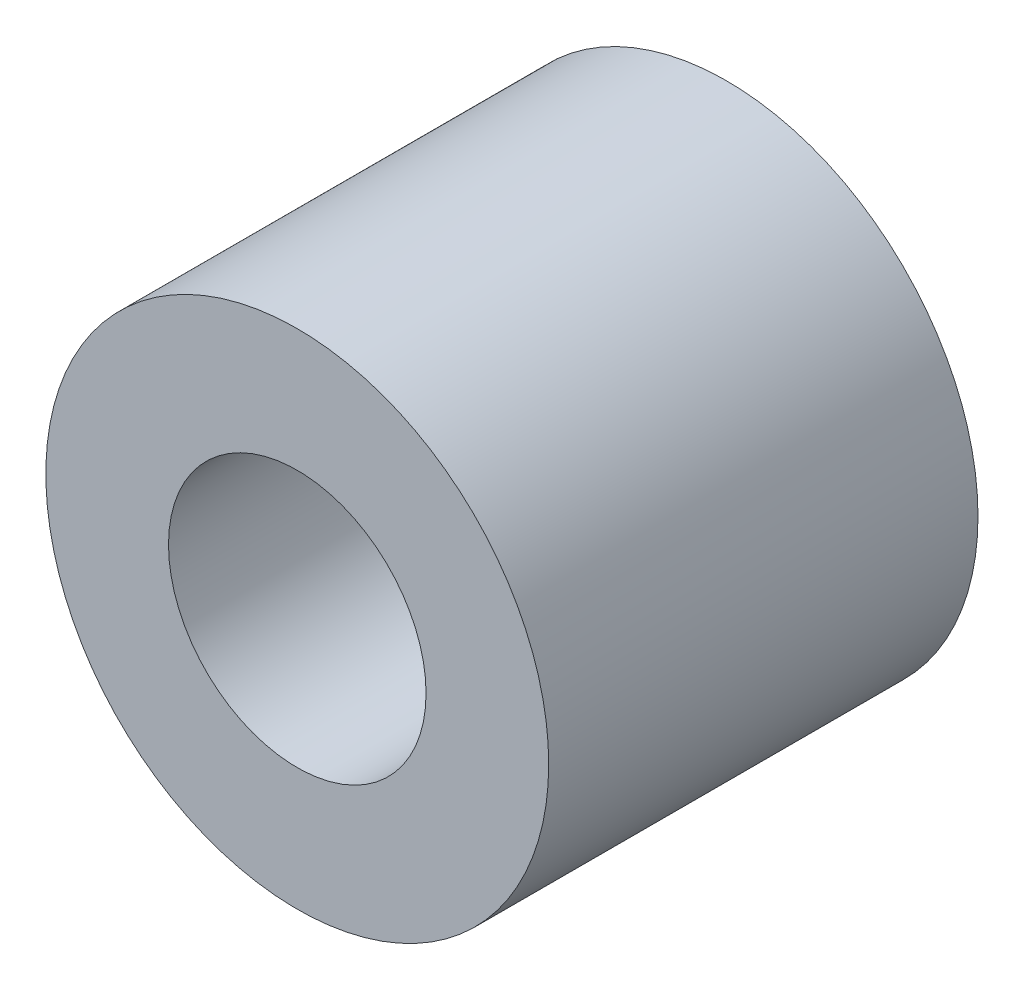
ISO-10303-21;
HEADER;
FILE_DESCRIPTION(('STEP AP214'),'2;1');
FILE_NAME('part.step','',(''),(''),'','','');
FILE_SCHEMA(('AUTOMOTIVE_DESIGN { 1 0 10303 214 1 1 1 1 }'));
ENDSEC;
DATA;
#1=APPLICATION_CONTEXT('core data for automotive mechanical design processes');
#2=APPLICATION_PROTOCOL_DEFINITION('international standard','automotive_design',2000,#1);
#3=PRODUCT_CONTEXT('',#1,'mechanical');
#4=PRODUCT('Part','Part','',(#3));
#5=PRODUCT_RELATED_PRODUCT_CATEGORY('part','',(#4));
#6=PRODUCT_DEFINITION_FORMATION('','',#4);
#7=PRODUCT_DEFINITION_CONTEXT('part definition',#1,'design');
#8=PRODUCT_DEFINITION('design','',#6,#7);
#9=PRODUCT_DEFINITION_SHAPE('','',#8);
#10=(LENGTH_UNIT() NAMED_UNIT(*) SI_UNIT(.MILLI.,.METRE.));
#11=(NAMED_UNIT(*) PLANE_ANGLE_UNIT() SI_UNIT($,.RADIAN.));
#12=(NAMED_UNIT(*) SI_UNIT($,.STERADIAN.) SOLID_ANGLE_UNIT());
#13=UNCERTAINTY_MEASURE_WITH_UNIT(LENGTH_MEASURE(1.E-05),#10,'distance_accuracy_value','');
#14=(GEOMETRIC_REPRESENTATION_CONTEXT(3) GLOBAL_UNCERTAINTY_ASSIGNED_CONTEXT((#13)) GLOBAL_UNIT_ASSIGNED_CONTEXT((#10,
#11,#12)) REPRESENTATION_CONTEXT('',''));
#15=CARTESIAN_POINT('',(0.,0.,0.));
#16=DIRECTION('',(0.,0.,1.));
#17=DIRECTION('',(1.,0.,0.));
#18=AXIS2_PLACEMENT_3D('',#15,#16,#17);
#19=CARTESIAN_POINT('',(0.,0.,10.5));
#20=DIRECTION('',(0.,0.,1.));
#21=DIRECTION('',(1.,0.,0.));
#22=AXIS2_PLACEMENT_3D('',#19,#20,#21);
#23=PLANE('',#22);
#24=CARTESIAN_POINT('',(0.,0.,10.5));
#25=DIRECTION('',(0.,0.,1.));
#26=DIRECTION('',(1.,0.,0.));
#27=AXIS2_PLACEMENT_3D('',#24,#25,#26);
#28=CIRCLE('',#27,6.15);
#29=CARTESIAN_POINT('',(6.15,0.,10.5));
#30=VERTEX_POINT('',#29);
#31=EDGE_CURVE('E10',#30,#30,#28,.T.);
#32=ORIENTED_EDGE('',*,*,#31,.T.);
#33=EDGE_LOOP('',(#32));
#34=FACE_BOUND('',#33,.T.);
#35=CARTESIAN_POINT('',(0.,0.,10.5));
#36=DIRECTION('',(0.,0.,1.));
#37=DIRECTION('',(1.,0.,0.));
#38=AXIS2_PLACEMENT_3D('',#35,#36,#37);
#39=CIRCLE('',#38,3.15);
#40=CARTESIAN_POINT('',(3.15,0.,10.5));
#41=VERTEX_POINT('',#40);
#42=EDGE_CURVE('E50',#41,#41,#39,.T.);
#43=ORIENTED_EDGE('',*,*,#42,.F.);
#44=EDGE_LOOP('',(#43));
#45=FACE_BOUND('',#44,.T.);
#46=ADVANCED_FACE('F37',(#34,#45),#23,.T.);
#47=CARTESIAN_POINT('',(0.,0.,0.));
#48=DIRECTION('',(0.,0.,1.));
#49=DIRECTION('',(1.,0.,0.));
#50=AXIS2_PLACEMENT_3D('',#47,#48,#49);
#51=PLANE('',#50);
#52=CARTESIAN_POINT('',(0.,0.,0.));
#53=DIRECTION('',(0.,0.,1.));
#54=DIRECTION('',(1.,0.,0.));
#55=AXIS2_PLACEMENT_3D('',#52,#53,#54);
#56=CIRCLE('',#55,6.15);
#57=CARTESIAN_POINT('',(6.15,0.,0.));
#58=VERTEX_POINT('',#57);
#59=EDGE_CURVE('E41',#58,#58,#56,.T.);
#60=ORIENTED_EDGE('',*,*,#59,.F.);
#61=EDGE_LOOP('',(#60));
#62=FACE_BOUND('',#61,.T.);
#63=CARTESIAN_POINT('',(0.,0.,0.));
#64=DIRECTION('',(0.,0.,1.));
#65=DIRECTION('',(1.,0.,0.));
#66=AXIS2_PLACEMENT_3D('',#63,#64,#65);
#67=CIRCLE('',#66,3.15);
#68=CARTESIAN_POINT('',(3.15,0.,0.));
#69=VERTEX_POINT('',#68);
#70=EDGE_CURVE('E52',#69,#69,#67,.T.);
#71=ORIENTED_EDGE('',*,*,#70,.T.);
#72=EDGE_LOOP('',(#71));
#73=FACE_BOUND('',#72,.T.);
#74=ADVANCED_FACE('F64',(#62,#73),#51,.F.);
#75=CARTESIAN_POINT('',(0.,0.,10.5));
#76=DIRECTION('',(0.,0.,-1.));
#77=DIRECTION('',(-1.,0.,0.));
#78=AXIS2_PLACEMENT_3D('',#75,#76,#77);
#79=CYLINDRICAL_SURFACE('',#78,6.15);
#80=ORIENTED_EDGE('',*,*,#31,.F.);
#81=EDGE_LOOP('',(#80));
#82=FACE_BOUND('',#81,.T.);
#83=ORIENTED_EDGE('',*,*,#59,.T.);
#84=EDGE_LOOP('',(#83));
#85=FACE_BOUND('',#84,.T.);
#86=ADVANCED_FACE('F39',(#82,#85),#79,.T.);
#87=CARTESIAN_POINT('',(0.,0.,10.5));
#88=DIRECTION('',(0.,0.,-1.));
#89=DIRECTION('',(-1.,0.,0.));
#90=AXIS2_PLACEMENT_3D('',#87,#88,#89);
#91=CYLINDRICAL_SURFACE('',#90,3.15);
#92=ORIENTED_EDGE('',*,*,#42,.T.);
#93=EDGE_LOOP('',(#92));
#94=FACE_BOUND('',#93,.T.);
#95=ORIENTED_EDGE('',*,*,#70,.F.);
#96=EDGE_LOOP('',(#95));
#97=FACE_BOUND('',#96,.T.);
#98=ADVANCED_FACE('F60',(#94,#97),#91,.F.);
#99=CLOSED_SHELL('',(#46,#74,#86,#98));
#100=MANIFOLD_SOLID_BREP('B2',#99);
#101=ADVANCED_BREP_SHAPE_REPRESENTATION('',(#18,#100),#14);
#102=SHAPE_DEFINITION_REPRESENTATION(#9,#101);
ENDSEC;
END-ISO-10303-21;
